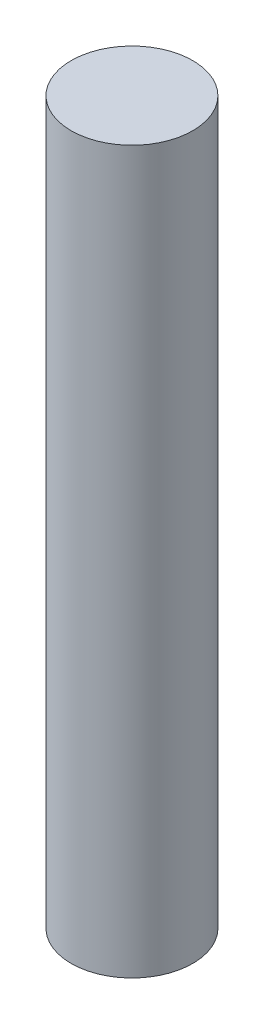
ISO-10303-21;
HEADER;
FILE_DESCRIPTION(('STEP AP214'),'2;1');
FILE_NAME('part.step','',(''),(''),'','','');
FILE_SCHEMA(('AUTOMOTIVE_DESIGN { 1 0 10303 214 1 1 1 1 }'));
ENDSEC;
DATA;
#1=APPLICATION_CONTEXT('core data for automotive mechanical design processes');
#2=APPLICATION_PROTOCOL_DEFINITION('international standard','automotive_design',2000,#1);
#3=PRODUCT_CONTEXT('',#1,'mechanical');
#4=PRODUCT('Part','Part','',(#3));
#5=PRODUCT_RELATED_PRODUCT_CATEGORY('part','',(#4));
#6=PRODUCT_DEFINITION_FORMATION('','',#4);
#7=PRODUCT_DEFINITION_CONTEXT('part definition',#1,'design');
#8=PRODUCT_DEFINITION('design','',#6,#7);
#9=PRODUCT_DEFINITION_SHAPE('','',#8);
#10=(LENGTH_UNIT() NAMED_UNIT(*) SI_UNIT(.MILLI.,.METRE.));
#11=(NAMED_UNIT(*) PLANE_ANGLE_UNIT() SI_UNIT($,.RADIAN.));
#12=(NAMED_UNIT(*) SI_UNIT($,.STERADIAN.) SOLID_ANGLE_UNIT());
#13=UNCERTAINTY_MEASURE_WITH_UNIT(LENGTH_MEASURE(1.E-05),#10,'distance_accuracy_value','');
#14=(GEOMETRIC_REPRESENTATION_CONTEXT(3) GLOBAL_UNCERTAINTY_ASSIGNED_CONTEXT((#13)) GLOBAL_UNIT_ASSIGNED_CONTEXT((#10,
#11,#12)) REPRESENTATION_CONTEXT('',''));
#15=CARTESIAN_POINT('',(0.,0.,0.));
#16=DIRECTION('',(0.,0.,1.));
#17=DIRECTION('',(1.,0.,0.));
#18=AXIS2_PLACEMENT_3D('',#15,#16,#17);
#19=CARTESIAN_POINT('',(0.,-454.2,0.));
#20=DIRECTION('',(0.,1.,0.));
#21=DIRECTION('',(0.,0.,1.));
#22=AXIS2_PLACEMENT_3D('',#19,#20,#21);
#23=PLANE('',#22);
#24=CARTESIAN_POINT('',(0.,-454.2,0.));
#25=DIRECTION('',(0.,1.,0.));
#26=DIRECTION('',(0.,0.,1.));
#27=AXIS2_PLACEMENT_3D('',#24,#25,#26);
#28=CIRCLE('',#27,77.);
#29=CARTESIAN_POINT('',(0.,-454.2,77.));
#30=VERTEX_POINT('',#29);
#31=EDGE_CURVE('E10',#30,#30,#28,.T.);
#32=ORIENTED_EDGE('',*,*,#31,.F.);
#33=EDGE_LOOP('',(#32));
#34=FACE_BOUND('',#33,.T.);
#35=CARTESIAN_POINT('',(0.,-454.2,0.));
#36=DIRECTION('',(0.,1.,0.));
#37=DIRECTION('',(0.,0.,1.));
#38=AXIS2_PLACEMENT_3D('',#35,#36,#37);
#39=CIRCLE('',#38,72.);
#40=CARTESIAN_POINT('',(0.,-454.2,72.));
#41=VERTEX_POINT('',#40);
#42=EDGE_CURVE('E37',#41,#41,#39,.T.);
#43=ORIENTED_EDGE('',*,*,#42,.T.);
#44=EDGE_LOOP('',(#43));
#45=FACE_BOUND('',#44,.T.);
#46=ADVANCED_FACE('F30',(#34,#45),#23,.F.);
#47=CARTESIAN_POINT('',(0.,454.2,0.));
#48=DIRECTION('',(0.,-1.,0.));
#49=DIRECTION('',(0.,0.,-1.));
#50=AXIS2_PLACEMENT_3D('',#47,#48,#49);
#51=CYLINDRICAL_SURFACE('',#50,77.);
#52=ORIENTED_EDGE('',*,*,#31,.T.);
#53=EDGE_LOOP('',(#52));
#54=FACE_BOUND('',#53,.T.);
#55=CARTESIAN_POINT('',(0.,459.2,0.));
#56=DIRECTION('',(0.,1.,0.));
#57=DIRECTION('',(0.,0.,1.));
#58=AXIS2_PLACEMENT_3D('',#55,#56,#57);
#59=CIRCLE('',#58,77.);
#60=CARTESIAN_POINT('',(0.,459.2,77.));
#61=VERTEX_POINT('',#60);
#62=EDGE_CURVE('E45',#61,#61,#59,.T.);
#63=ORIENTED_EDGE('',*,*,#62,.F.);
#64=EDGE_LOOP('',(#63));
#65=FACE_BOUND('',#64,.T.);
#66=ADVANCED_FACE('F32',(#54,#65),#51,.T.);
#67=CARTESIAN_POINT('',(0.,454.2,0.));
#68=DIRECTION('',(0.,-1.,0.));
#69=DIRECTION('',(0.,0.,-1.));
#70=AXIS2_PLACEMENT_3D('',#67,#68,#69);
#71=CYLINDRICAL_SURFACE('',#70,72.);
#72=CARTESIAN_POINT('',(0.,454.2,0.));
#73=DIRECTION('',(0.,1.,0.));
#74=DIRECTION('',(0.,0.,1.));
#75=AXIS2_PLACEMENT_3D('',#72,#73,#74);
#76=CIRCLE('',#75,72.);
#77=CARTESIAN_POINT('',(0.,454.2,72.));
#78=VERTEX_POINT('',#77);
#79=EDGE_CURVE('E41',#78,#78,#76,.T.);
#80=ORIENTED_EDGE('',*,*,#79,.T.);
#81=EDGE_LOOP('',(#80));
#82=FACE_BOUND('',#81,.T.);
#83=ORIENTED_EDGE('',*,*,#42,.F.);
#84=EDGE_LOOP('',(#83));
#85=FACE_BOUND('',#84,.T.);
#86=ADVANCED_FACE('F54',(#82,#85),#71,.F.);
#87=CARTESIAN_POINT('',(0.,454.2,0.));
#88=DIRECTION('',(0.,1.,0.));
#89=DIRECTION('',(0.,0.,1.));
#90=AXIS2_PLACEMENT_3D('',#87,#88,#89);
#91=PLANE('',#90);
#92=ORIENTED_EDGE('',*,*,#79,.F.);
#93=EDGE_LOOP('',(#92));
#94=FACE_BOUND('',#93,.T.);
#95=ADVANCED_FACE('F59',(#94),#91,.F.);
#96=CARTESIAN_POINT('',(0.,459.2,0.));
#97=DIRECTION('',(0.,1.,0.));
#98=DIRECTION('',(0.,0.,1.));
#99=AXIS2_PLACEMENT_3D('',#96,#97,#98);
#100=PLANE('',#99);
#101=ORIENTED_EDGE('',*,*,#62,.T.);
#102=EDGE_LOOP('',(#101));
#103=FACE_BOUND('',#102,.T.);
#104=ADVANCED_FACE('F51',(#103),#100,.T.);
#105=CLOSED_SHELL('',(#46,#66,#86,#95,#104));
#106=MANIFOLD_SOLID_BREP('B2',#105);
#107=ADVANCED_BREP_SHAPE_REPRESENTATION('',(#18,#106),#14);
#108=SHAPE_DEFINITION_REPRESENTATION(#9,#107);
ENDSEC;
END-ISO-10303-21;
